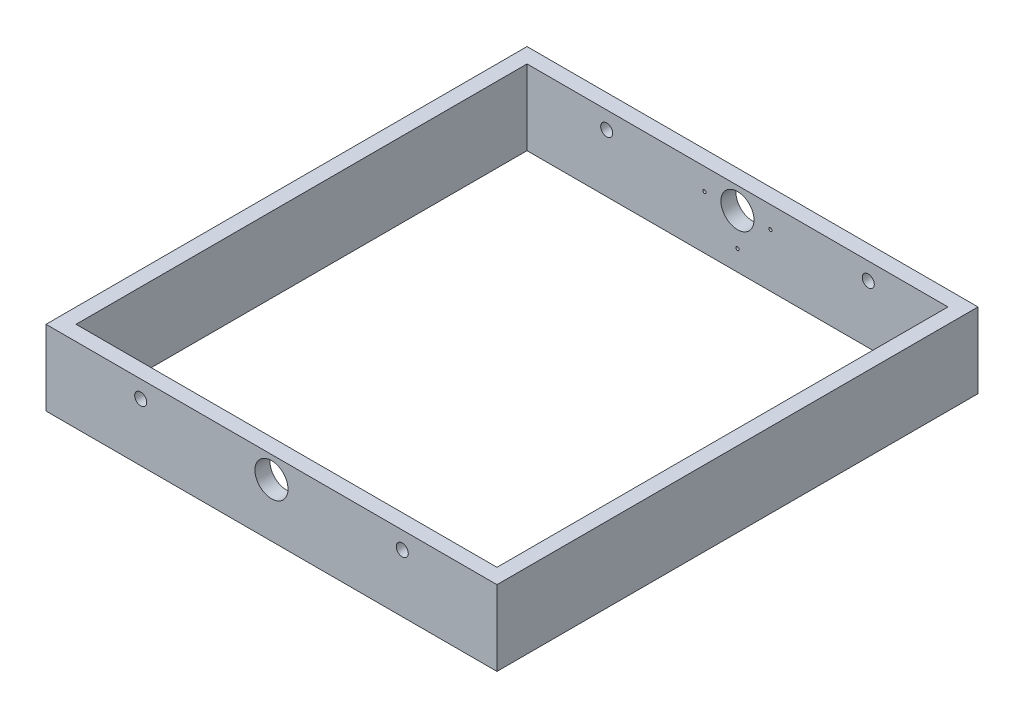
ISO-10303-21;
HEADER;
FILE_DESCRIPTION(('STEP AP214'),'2;1');
FILE_NAME('part.step','',(''),(''),'','','');
FILE_SCHEMA(('AUTOMOTIVE_DESIGN { 1 0 10303 214 1 1 1 1 }'));
ENDSEC;
DATA;
#1=APPLICATION_CONTEXT('core data for automotive mechanical design processes');
#2=APPLICATION_PROTOCOL_DEFINITION('international standard','automotive_design',2000,#1);
#3=PRODUCT_CONTEXT('',#1,'mechanical');
#4=PRODUCT('Part','Part','',(#3));
#5=PRODUCT_RELATED_PRODUCT_CATEGORY('part','',(#4));
#6=PRODUCT_DEFINITION_FORMATION('','',#4);
#7=PRODUCT_DEFINITION_CONTEXT('part definition',#1,'design');
#8=PRODUCT_DEFINITION('design','',#6,#7);
#9=PRODUCT_DEFINITION_SHAPE('','',#8);
#10=(LENGTH_UNIT() NAMED_UNIT(*) SI_UNIT(.MILLI.,.METRE.));
#11=(NAMED_UNIT(*) PLANE_ANGLE_UNIT() SI_UNIT($,.RADIAN.));
#12=(NAMED_UNIT(*) SI_UNIT($,.STERADIAN.) SOLID_ANGLE_UNIT());
#13=UNCERTAINTY_MEASURE_WITH_UNIT(LENGTH_MEASURE(1.E-05),#10,'distance_accuracy_value','');
#14=(GEOMETRIC_REPRESENTATION_CONTEXT(3) GLOBAL_UNCERTAINTY_ASSIGNED_CONTEXT((#13)) GLOBAL_UNIT_ASSIGNED_CONTEXT((#10,
#11,#12)) REPRESENTATION_CONTEXT('',''));
#15=CARTESIAN_POINT('',(0.,0.,0.));
#16=DIRECTION('',(0.,0.,1.));
#17=DIRECTION('',(1.,0.,0.));
#18=AXIS2_PLACEMENT_3D('',#15,#16,#17);
#19=CARTESIAN_POINT('',(0.,50.,0.));
#20=DIRECTION('',(0.,-1.,0.));
#21=DIRECTION('',(0.,0.,-1.));
#22=AXIS2_PLACEMENT_3D('',#19,#20,#21);
#23=PLANE('',#22);
#24=DIRECTION('',(0.,0.,-1.));
#25=VECTOR('',#24,1.);
#26=CARTESIAN_POINT('',(150.,50.,160.));
#27=LINE('',#26,#25);
#28=CARTESIAN_POINT('',(150.,50.,160.));
#29=VERTEX_POINT('',#28);
#30=CARTESIAN_POINT('',(150.,50.,-160.));
#31=VERTEX_POINT('',#30);
#32=EDGE_CURVE('E137',#29,#31,#27,.T.);
#33=ORIENTED_EDGE('',*,*,#32,.T.);
#34=DIRECTION('',(-1.,0.,0.));
#35=VECTOR('',#34,1.);
#36=CARTESIAN_POINT('',(-150.,50.,-160.));
#37=LINE('',#36,#35);
#38=CARTESIAN_POINT('',(-150.,50.,-160.));
#39=VERTEX_POINT('',#38);
#40=EDGE_CURVE('E140',#31,#39,#37,.T.);
#41=ORIENTED_EDGE('',*,*,#40,.T.);
#42=DIRECTION('',(0.,0.,1.));
#43=VECTOR('',#42,1.);
#44=CARTESIAN_POINT('',(-150.,50.,160.));
#45=LINE('',#44,#43);
#46=CARTESIAN_POINT('',(-150.,50.,160.));
#47=VERTEX_POINT('',#46);
#48=EDGE_CURVE('E143',#39,#47,#45,.T.);
#49=ORIENTED_EDGE('',*,*,#48,.T.);
#50=DIRECTION('',(1.,0.,0.));
#51=VECTOR('',#50,1.);
#52=CARTESIAN_POINT('',(-150.,50.,160.));
#53=LINE('',#52,#51);
#54=EDGE_CURVE('E145',#47,#29,#53,.T.);
#55=ORIENTED_EDGE('',*,*,#54,.T.);
#56=EDGE_LOOP('',(#33,#41,#49,#55));
#57=FACE_BOUND('',#56,.T.);
#58=DIRECTION('',(0.,0.,-1.));
#59=VECTOR('',#58,1.);
#60=CARTESIAN_POINT('',(140.,50.,-150.));
#61=LINE('',#60,#59);
#62=CARTESIAN_POINT('',(140.,50.,150.));
#63=VERTEX_POINT('',#62);
#64=CARTESIAN_POINT('',(140.,50.,-150.));
#65=VERTEX_POINT('',#64);
#66=EDGE_CURVE('E99',#63,#65,#61,.T.);
#67=ORIENTED_EDGE('',*,*,#66,.F.);
#68=DIRECTION('',(1.,0.,0.));
#69=VECTOR('',#68,1.);
#70=CARTESIAN_POINT('',(-140.,50.,150.));
#71=LINE('',#70,#69);
#72=CARTESIAN_POINT('',(-140.,50.,150.));
#73=VERTEX_POINT('',#72);
#74=EDGE_CURVE('E121',#73,#63,#71,.T.);
#75=ORIENTED_EDGE('',*,*,#74,.F.);
#76=DIRECTION('',(0.,0.,1.));
#77=VECTOR('',#76,1.);
#78=CARTESIAN_POINT('',(-140.,50.,-150.));
#79=LINE('',#78,#77);
#80=CARTESIAN_POINT('',(-140.,50.,-150.));
#81=VERTEX_POINT('',#80);
#82=EDGE_CURVE('E119',#81,#73,#79,.T.);
#83=ORIENTED_EDGE('',*,*,#82,.F.);
#84=DIRECTION('',(-1.,0.,0.));
#85=VECTOR('',#84,1.);
#86=CARTESIAN_POINT('',(-140.,50.,-150.));
#87=LINE('',#86,#85);
#88=EDGE_CURVE('E107',#65,#81,#87,.T.);
#89=ORIENTED_EDGE('',*,*,#88,.F.);
#90=EDGE_LOOP('',(#67,#75,#83,#89));
#91=FACE_BOUND('',#90,.T.);
#92=ADVANCED_FACE('F32',(#57,#91),#23,.F.);
#93=CARTESIAN_POINT('',(0.,0.,0.));
#94=DIRECTION('',(0.,-1.,0.));
#95=DIRECTION('',(0.,0.,-1.));
#96=AXIS2_PLACEMENT_3D('',#93,#94,#95);
#97=PLANE('',#96);
#98=DIRECTION('',(0.,0.,-1.));
#99=VECTOR('',#98,1.);
#100=CARTESIAN_POINT('',(150.,0.,160.));
#101=LINE('',#100,#99);
#102=CARTESIAN_POINT('',(150.,0.,160.));
#103=VERTEX_POINT('',#102);
#104=CARTESIAN_POINT('',(150.,0.,-160.));
#105=VERTEX_POINT('',#104);
#106=EDGE_CURVE('E115',#103,#105,#101,.T.);
#107=ORIENTED_EDGE('',*,*,#106,.F.);
#108=DIRECTION('',(1.,0.,0.));
#109=VECTOR('',#108,1.);
#110=CARTESIAN_POINT('',(-150.,0.,160.));
#111=LINE('',#110,#109);
#112=CARTESIAN_POINT('',(-150.,0.,160.));
#113=VERTEX_POINT('',#112);
#114=EDGE_CURVE('E141',#113,#103,#111,.T.);
#115=ORIENTED_EDGE('',*,*,#114,.F.);
#116=DIRECTION('',(0.,0.,1.));
#117=VECTOR('',#116,1.);
#118=CARTESIAN_POINT('',(-150.,0.,160.));
#119=LINE('',#118,#117);
#120=CARTESIAN_POINT('',(-150.,0.,-160.));
#121=VERTEX_POINT('',#120);
#122=EDGE_CURVE('E152',#121,#113,#119,.T.);
#123=ORIENTED_EDGE('',*,*,#122,.F.);
#124=DIRECTION('',(-1.,0.,0.));
#125=VECTOR('',#124,1.);
#126=CARTESIAN_POINT('',(-150.,0.,-160.));
#127=LINE('',#126,#125);
#128=EDGE_CURVE('E150',#105,#121,#127,.T.);
#129=ORIENTED_EDGE('',*,*,#128,.F.);
#130=EDGE_LOOP('',(#107,#115,#123,#129));
#131=FACE_BOUND('',#130,.T.);
#132=DIRECTION('',(1.,0.,0.));
#133=VECTOR('',#132,1.);
#134=CARTESIAN_POINT('',(-140.,0.,150.));
#135=LINE('',#134,#133);
#136=CARTESIAN_POINT('',(-140.,0.,150.));
#137=VERTEX_POINT('',#136);
#138=CARTESIAN_POINT('',(140.,0.,150.));
#139=VERTEX_POINT('',#138);
#140=EDGE_CURVE('E108',#137,#139,#135,.T.);
#141=ORIENTED_EDGE('',*,*,#140,.T.);
#142=DIRECTION('',(0.,0.,-1.));
#143=VECTOR('',#142,1.);
#144=CARTESIAN_POINT('',(140.,0.,-150.));
#145=LINE('',#144,#143);
#146=CARTESIAN_POINT('',(140.,0.,-150.));
#147=VERTEX_POINT('',#146);
#148=EDGE_CURVE('E57',#139,#147,#145,.T.);
#149=ORIENTED_EDGE('',*,*,#148,.T.);
#150=DIRECTION('',(-1.,0.,0.));
#151=VECTOR('',#150,1.);
#152=CARTESIAN_POINT('',(-140.,0.,-150.));
#153=LINE('',#152,#151);
#154=CARTESIAN_POINT('',(-140.,0.,-150.));
#155=VERTEX_POINT('',#154);
#156=EDGE_CURVE('E114',#147,#155,#153,.T.);
#157=ORIENTED_EDGE('',*,*,#156,.T.);
#158=DIRECTION('',(0.,0.,1.));
#159=VECTOR('',#158,1.);
#160=CARTESIAN_POINT('',(-140.,0.,-150.));
#161=LINE('',#160,#159);
#162=EDGE_CURVE('E129',#155,#137,#161,.T.);
#163=ORIENTED_EDGE('',*,*,#162,.T.);
#164=EDGE_LOOP('',(#141,#149,#157,#163));
#165=FACE_BOUND('',#164,.T.);
#166=ADVANCED_FACE('F199',(#131,#165),#97,.T.);
#167=CARTESIAN_POINT('',(150.,50.,160.));
#168=DIRECTION('',(-1.,0.,0.));
#169=DIRECTION('',(0.,0.,1.));
#170=AXIS2_PLACEMENT_3D('',#167,#168,#169);
#171=PLANE('',#170);
#172=ORIENTED_EDGE('',*,*,#106,.T.);
#173=DIRECTION('',(0.,-1.,0.));
#174=VECTOR('',#173,1.);
#175=CARTESIAN_POINT('',(150.,50.,-160.));
#176=LINE('',#175,#174);
#177=EDGE_CURVE('E11',#31,#105,#176,.T.);
#178=ORIENTED_EDGE('',*,*,#177,.F.);
#179=ORIENTED_EDGE('',*,*,#32,.F.);
#180=DIRECTION('',(0.,-1.,0.));
#181=VECTOR('',#180,1.);
#182=CARTESIAN_POINT('',(150.,50.,160.));
#183=LINE('',#182,#181);
#184=EDGE_CURVE('E147',#29,#103,#183,.T.);
#185=ORIENTED_EDGE('',*,*,#184,.T.);
#186=EDGE_LOOP('',(#172,#178,#179,#185));
#187=FACE_BOUND('',#186,.T.);
#188=ADVANCED_FACE('F34',(#187),#171,.F.);
#189=CARTESIAN_POINT('',(-150.,50.,-160.));
#190=DIRECTION('',(0.,0.,1.));
#191=DIRECTION('',(1.,0.,0.));
#192=AXIS2_PLACEMENT_3D('',#189,#190,#191);
#193=PLANE('',#192);
#194=CARTESIAN_POINT('',(0.,13.579689783217,-160.));
#195=DIRECTION('',(0.,0.,-1.));
#196=DIRECTION('',(-1.,0.,0.));
#197=AXIS2_PLACEMENT_3D('',#194,#195,#196);
#198=CIRCLE('',#197,1.09);
#199=CARTESIAN_POINT('',(-1.08999999999999,13.579689783217,-160.));
#200=VERTEX_POINT('',#199);
#201=EDGE_CURVE('E235',#200,#200,#198,.T.);
#202=ORIENTED_EDGE('',*,*,#201,.F.);
#203=EDGE_LOOP('',(#202));
#204=FACE_BOUND('',#203,.T.);
#205=CARTESIAN_POINT('',(21.920310216783,35.5,-160.));
#206=DIRECTION('',(0.,0.,-1.));
#207=DIRECTION('',(-1.,0.,0.));
#208=AXIS2_PLACEMENT_3D('',#205,#206,#207);
#209=CIRCLE('',#208,1.09);
#210=CARTESIAN_POINT('',(20.830310216783,35.5,-160.));
#211=VERTEX_POINT('',#210);
#212=EDGE_CURVE('E239',#211,#211,#209,.T.);
#213=ORIENTED_EDGE('',*,*,#212,.F.);
#214=EDGE_LOOP('',(#213));
#215=FACE_BOUND('',#214,.T.);
#216=CARTESIAN_POINT('',(-21.920310216783,35.5,-160.));
#217=DIRECTION('',(0.,0.,-1.));
#218=DIRECTION('',(-1.,0.,0.));
#219=AXIS2_PLACEMENT_3D('',#216,#217,#218);
#220=CIRCLE('',#219,1.09);
#221=CARTESIAN_POINT('',(-23.010310216783,35.5,-160.));
#222=VERTEX_POINT('',#221);
#223=EDGE_CURVE('E243',#222,#222,#220,.T.);
#224=ORIENTED_EDGE('',*,*,#223,.F.);
#225=EDGE_LOOP('',(#224));
#226=FACE_BOUND('',#225,.T.);
#227=CARTESIAN_POINT('',(-87.,38.5,-160.));
#228=DIRECTION('',(0.,0.,1.));
#229=DIRECTION('',(1.,0.,0.));
#230=AXIS2_PLACEMENT_3D('',#227,#228,#229);
#231=CIRCLE('',#230,4.00000000000001);
#232=CARTESIAN_POINT('',(-83.,38.5,-160.));
#233=VERTEX_POINT('',#232);
#234=EDGE_CURVE('E165',#233,#233,#231,.T.);
#235=ORIENTED_EDGE('',*,*,#234,.T.);
#236=EDGE_LOOP('',(#235));
#237=FACE_BOUND('',#236,.T.);
#238=CARTESIAN_POINT('',(0.,35.5,-160.));
#239=DIRECTION('',(0.,0.,1.));
#240=DIRECTION('',(1.,0.,0.));
#241=AXIS2_PLACEMENT_3D('',#238,#239,#240);
#242=CIRCLE('',#241,11.);
#243=CARTESIAN_POINT('',(11.,35.5,-160.));
#244=VERTEX_POINT('',#243);
#245=EDGE_CURVE('E250',#244,#244,#242,.T.);
#246=ORIENTED_EDGE('',*,*,#245,.T.);
#247=EDGE_LOOP('',(#246));
#248=FACE_BOUND('',#247,.T.);
#249=CARTESIAN_POINT('',(87.,38.5,-160.));
#250=DIRECTION('',(0.,0.,1.));
#251=DIRECTION('',(1.,0.,0.));
#252=AXIS2_PLACEMENT_3D('',#249,#250,#251);
#253=CIRCLE('',#252,4.00000000000001);
#254=CARTESIAN_POINT('',(91.,38.5,-160.));
#255=VERTEX_POINT('',#254);
#256=EDGE_CURVE('E254',#255,#255,#253,.T.);
#257=ORIENTED_EDGE('',*,*,#256,.T.);
#258=EDGE_LOOP('',(#257));
#259=FACE_BOUND('',#258,.T.);
#260=ORIENTED_EDGE('',*,*,#128,.T.);
#261=DIRECTION('',(0.,-1.,0.));
#262=VECTOR('',#261,1.);
#263=CARTESIAN_POINT('',(-150.,50.,-160.));
#264=LINE('',#263,#262);
#265=EDGE_CURVE('E41',#39,#121,#264,.T.);
#266=ORIENTED_EDGE('',*,*,#265,.F.);
#267=ORIENTED_EDGE('',*,*,#40,.F.);
#268=ORIENTED_EDGE('',*,*,#177,.T.);
#269=EDGE_LOOP('',(#260,#266,#267,#268));
#270=FACE_BOUND('',#269,.T.);
#271=ADVANCED_FACE('F224',(#204,#215,#226,#237,#248,#259,#270),#193,.F.);
#272=CARTESIAN_POINT('',(-150.,50.,160.));
#273=DIRECTION('',(1.,0.,0.));
#274=DIRECTION('',(0.,0.,-1.));
#275=AXIS2_PLACEMENT_3D('',#272,#273,#274);
#276=PLANE('',#275);
#277=ORIENTED_EDGE('',*,*,#122,.T.);
#278=DIRECTION('',(0.,-1.,0.));
#279=VECTOR('',#278,1.);
#280=CARTESIAN_POINT('',(-150.,50.,160.));
#281=LINE('',#280,#279);
#282=EDGE_CURVE('E157',#47,#113,#281,.T.);
#283=ORIENTED_EDGE('',*,*,#282,.F.);
#284=ORIENTED_EDGE('',*,*,#48,.F.);
#285=ORIENTED_EDGE('',*,*,#265,.T.);
#286=EDGE_LOOP('',(#277,#283,#284,#285));
#287=FACE_BOUND('',#286,.T.);
#288=ADVANCED_FACE('F221',(#287),#276,.F.);
#289=CARTESIAN_POINT('',(-150.,50.,160.));
#290=DIRECTION('',(0.,0.,-1.));
#291=DIRECTION('',(-1.,0.,0.));
#292=AXIS2_PLACEMENT_3D('',#289,#290,#291);
#293=PLANE('',#292);
#294=CARTESIAN_POINT('',(-87.,38.5,160.));
#295=DIRECTION('',(0.,0.,1.));
#296=DIRECTION('',(1.,0.,0.));
#297=AXIS2_PLACEMENT_3D('',#294,#295,#296);
#298=CIRCLE('',#297,4.00000000000001);
#299=CARTESIAN_POINT('',(-83.,38.5,160.));
#300=VERTEX_POINT('',#299);
#301=EDGE_CURVE('E274',#300,#300,#298,.T.);
#302=ORIENTED_EDGE('',*,*,#301,.F.);
#303=EDGE_LOOP('',(#302));
#304=FACE_BOUND('',#303,.T.);
#305=CARTESIAN_POINT('',(0.,35.5,160.));
#306=DIRECTION('',(0.,0.,1.));
#307=DIRECTION('',(1.,0.,0.));
#308=AXIS2_PLACEMENT_3D('',#305,#306,#307);
#309=CIRCLE('',#308,11.);
#310=CARTESIAN_POINT('',(11.,35.5,160.));
#311=VERTEX_POINT('',#310);
#312=EDGE_CURVE('E267',#311,#311,#309,.T.);
#313=ORIENTED_EDGE('',*,*,#312,.F.);
#314=EDGE_LOOP('',(#313));
#315=FACE_BOUND('',#314,.T.);
#316=CARTESIAN_POINT('',(87.,38.5,160.));
#317=DIRECTION('',(0.,0.,1.));
#318=DIRECTION('',(1.,0.,0.));
#319=AXIS2_PLACEMENT_3D('',#316,#317,#318);
#320=CIRCLE('',#319,4.00000000000001);
#321=CARTESIAN_POINT('',(91.,38.5,160.));
#322=VERTEX_POINT('',#321);
#323=EDGE_CURVE('E178',#322,#322,#320,.T.);
#324=ORIENTED_EDGE('',*,*,#323,.F.);
#325=EDGE_LOOP('',(#324));
#326=FACE_BOUND('',#325,.T.);
#327=ORIENTED_EDGE('',*,*,#114,.T.);
#328=ORIENTED_EDGE('',*,*,#184,.F.);
#329=ORIENTED_EDGE('',*,*,#54,.F.);
#330=ORIENTED_EDGE('',*,*,#282,.T.);
#331=EDGE_LOOP('',(#327,#328,#329,#330));
#332=FACE_BOUND('',#331,.T.);
#333=ADVANCED_FACE('F218',(#304,#315,#326,#332),#293,.F.);
#334=CARTESIAN_POINT('',(140.,50.,-150.));
#335=DIRECTION('',(-1.,0.,0.));
#336=DIRECTION('',(0.,0.,1.));
#337=AXIS2_PLACEMENT_3D('',#334,#335,#336);
#338=PLANE('',#337);
#339=ORIENTED_EDGE('',*,*,#148,.F.);
#340=DIRECTION('',(0.,-1.,0.));
#341=VECTOR('',#340,1.);
#342=CARTESIAN_POINT('',(140.,50.,150.));
#343=LINE('',#342,#341);
#344=EDGE_CURVE('E103',#63,#139,#343,.T.);
#345=ORIENTED_EDGE('',*,*,#344,.F.);
#346=ORIENTED_EDGE('',*,*,#66,.T.);
#347=DIRECTION('',(0.,-1.,0.));
#348=VECTOR('',#347,1.);
#349=CARTESIAN_POINT('',(140.,50.,-150.));
#350=LINE('',#349,#348);
#351=EDGE_CURVE('E102',#65,#147,#350,.T.);
#352=ORIENTED_EDGE('',*,*,#351,.T.);
#353=EDGE_LOOP('',(#339,#345,#346,#352));
#354=FACE_BOUND('',#353,.T.);
#355=ADVANCED_FACE('F101',(#354),#338,.T.);
#356=CARTESIAN_POINT('',(-140.,50.,-150.));
#357=DIRECTION('',(0.,0.,1.));
#358=DIRECTION('',(1.,0.,0.));
#359=AXIS2_PLACEMENT_3D('',#356,#357,#358);
#360=PLANE('',#359);
#361=CARTESIAN_POINT('',(0.,13.579689783217,-150.));
#362=DIRECTION('',(0.,0.,1.));
#363=DIRECTION('',(1.,0.,0.));
#364=AXIS2_PLACEMENT_3D('',#361,#362,#363);
#365=CIRCLE('',#364,1.09);
#366=CARTESIAN_POINT('',(1.09000000000001,13.579689783217,-150.));
#367=VERTEX_POINT('',#366);
#368=EDGE_CURVE('E271',#367,#367,#365,.F.);
#369=ORIENTED_EDGE('',*,*,#368,.T.);
#370=EDGE_LOOP('',(#369));
#371=FACE_BOUND('',#370,.T.);
#372=CARTESIAN_POINT('',(21.920310216783,35.5,-150.));
#373=DIRECTION('',(0.,0.,1.));
#374=DIRECTION('',(1.,0.,0.));
#375=AXIS2_PLACEMENT_3D('',#372,#373,#374);
#376=CIRCLE('',#375,1.09);
#377=CARTESIAN_POINT('',(23.010310216783,35.5,-150.));
#378=VERTEX_POINT('',#377);
#379=EDGE_CURVE('E282',#378,#378,#376,.F.);
#380=ORIENTED_EDGE('',*,*,#379,.T.);
#381=EDGE_LOOP('',(#380));
#382=FACE_BOUND('',#381,.T.);
#383=CARTESIAN_POINT('',(-21.920310216783,35.5,-150.));
#384=DIRECTION('',(0.,0.,1.));
#385=DIRECTION('',(1.,0.,0.));
#386=AXIS2_PLACEMENT_3D('',#383,#384,#385);
#387=CIRCLE('',#386,1.09);
#388=CARTESIAN_POINT('',(-20.830310216783,35.5,-150.));
#389=VERTEX_POINT('',#388);
#390=EDGE_CURVE('E278',#389,#389,#387,.F.);
#391=ORIENTED_EDGE('',*,*,#390,.T.);
#392=EDGE_LOOP('',(#391));
#393=FACE_BOUND('',#392,.T.);
#394=CARTESIAN_POINT('',(-87.,38.5,-150.));
#395=DIRECTION('',(0.,0.,1.));
#396=DIRECTION('',(1.,0.,0.));
#397=AXIS2_PLACEMENT_3D('',#394,#395,#396);
#398=CIRCLE('',#397,4.00000000000001);
#399=CARTESIAN_POINT('',(-83.,38.5,-150.));
#400=VERTEX_POINT('',#399);
#401=EDGE_CURVE('E127',#400,#400,#398,.T.);
#402=ORIENTED_EDGE('',*,*,#401,.F.);
#403=EDGE_LOOP('',(#402));
#404=FACE_BOUND('',#403,.T.);
#405=CARTESIAN_POINT('',(0.,35.5,-150.));
#406=DIRECTION('',(0.,0.,1.));
#407=DIRECTION('',(1.,0.,0.));
#408=AXIS2_PLACEMENT_3D('',#405,#406,#407);
#409=CIRCLE('',#408,11.);
#410=CARTESIAN_POINT('',(11.,35.5,-150.));
#411=VERTEX_POINT('',#410);
#412=EDGE_CURVE('E168',#411,#411,#409,.T.);
#413=ORIENTED_EDGE('',*,*,#412,.F.);
#414=EDGE_LOOP('',(#413));
#415=FACE_BOUND('',#414,.T.);
#416=CARTESIAN_POINT('',(87.,38.5,-150.));
#417=DIRECTION('',(0.,0.,1.));
#418=DIRECTION('',(1.,0.,0.));
#419=AXIS2_PLACEMENT_3D('',#416,#417,#418);
#420=CIRCLE('',#419,4.00000000000001);
#421=CARTESIAN_POINT('',(91.,38.5,-150.));
#422=VERTEX_POINT('',#421);
#423=EDGE_CURVE('E164',#422,#422,#420,.T.);
#424=ORIENTED_EDGE('',*,*,#423,.F.);
#425=EDGE_LOOP('',(#424));
#426=FACE_BOUND('',#425,.T.);
#427=ORIENTED_EDGE('',*,*,#156,.F.);
#428=ORIENTED_EDGE('',*,*,#351,.F.);
#429=ORIENTED_EDGE('',*,*,#88,.T.);
#430=DIRECTION('',(0.,-1.,0.));
#431=VECTOR('',#430,1.);
#432=CARTESIAN_POINT('',(-140.,50.,-150.));
#433=LINE('',#432,#431);
#434=EDGE_CURVE('E116',#81,#155,#433,.T.);
#435=ORIENTED_EDGE('',*,*,#434,.T.);
#436=EDGE_LOOP('',(#427,#428,#429,#435));
#437=FACE_BOUND('',#436,.T.);
#438=ADVANCED_FACE('F111',(#371,#382,#393,#404,#415,#426,#437),#360,.T.);
#439=CARTESIAN_POINT('',(-140.,50.,-150.));
#440=DIRECTION('',(1.,0.,0.));
#441=DIRECTION('',(0.,0.,-1.));
#442=AXIS2_PLACEMENT_3D('',#439,#440,#441);
#443=PLANE('',#442);
#444=ORIENTED_EDGE('',*,*,#162,.F.);
#445=ORIENTED_EDGE('',*,*,#434,.F.);
#446=ORIENTED_EDGE('',*,*,#82,.T.);
#447=DIRECTION('',(0.,-1.,0.));
#448=VECTOR('',#447,1.);
#449=CARTESIAN_POINT('',(-140.,50.,150.));
#450=LINE('',#449,#448);
#451=EDGE_CURVE('E49',#73,#137,#450,.T.);
#452=ORIENTED_EDGE('',*,*,#451,.T.);
#453=EDGE_LOOP('',(#444,#445,#446,#452));
#454=FACE_BOUND('',#453,.T.);
#455=ADVANCED_FACE('F193',(#454),#443,.T.);
#456=CARTESIAN_POINT('',(-140.,50.,150.));
#457=DIRECTION('',(0.,0.,-1.));
#458=DIRECTION('',(-1.,0.,0.));
#459=AXIS2_PLACEMENT_3D('',#456,#457,#458);
#460=PLANE('',#459);
#461=CARTESIAN_POINT('',(-87.,38.5,150.));
#462=DIRECTION('',(0.,0.,-1.));
#463=DIRECTION('',(-1.,0.,0.));
#464=AXIS2_PLACEMENT_3D('',#461,#462,#463);
#465=CIRCLE('',#464,4.00000000000001);
#466=CARTESIAN_POINT('',(-91.,38.5,150.));
#467=VERTEX_POINT('',#466);
#468=EDGE_CURVE('E36',#467,#467,#465,.T.);
#469=ORIENTED_EDGE('',*,*,#468,.F.);
#470=EDGE_LOOP('',(#469));
#471=FACE_BOUND('',#470,.T.);
#472=CARTESIAN_POINT('',(0.,35.5,150.));
#473=DIRECTION('',(0.,0.,-1.));
#474=DIRECTION('',(-1.,0.,0.));
#475=AXIS2_PLACEMENT_3D('',#472,#473,#474);
#476=CIRCLE('',#475,11.);
#477=CARTESIAN_POINT('',(-11.,35.5,150.));
#478=VERTEX_POINT('',#477);
#479=EDGE_CURVE('E166',#478,#478,#476,.T.);
#480=ORIENTED_EDGE('',*,*,#479,.F.);
#481=EDGE_LOOP('',(#480));
#482=FACE_BOUND('',#481,.T.);
#483=CARTESIAN_POINT('',(87.,38.5,150.));
#484=DIRECTION('',(0.,0.,-1.));
#485=DIRECTION('',(-1.,0.,0.));
#486=AXIS2_PLACEMENT_3D('',#483,#484,#485);
#487=CIRCLE('',#486,4.00000000000001);
#488=CARTESIAN_POINT('',(83.,38.5,150.));
#489=VERTEX_POINT('',#488);
#490=EDGE_CURVE('E162',#489,#489,#487,.T.);
#491=ORIENTED_EDGE('',*,*,#490,.F.);
#492=EDGE_LOOP('',(#491));
#493=FACE_BOUND('',#492,.T.);
#494=ORIENTED_EDGE('',*,*,#140,.F.);
#495=ORIENTED_EDGE('',*,*,#451,.F.);
#496=ORIENTED_EDGE('',*,*,#74,.T.);
#497=ORIENTED_EDGE('',*,*,#344,.T.);
#498=EDGE_LOOP('',(#494,#495,#496,#497));
#499=FACE_BOUND('',#498,.T.);
#500=ADVANCED_FACE('F189',(#471,#482,#493,#499),#460,.T.);
#501=CARTESIAN_POINT('',(87.,38.5,-160.));
#502=DIRECTION('',(0.,0.,1.));
#503=DIRECTION('',(1.,0.,0.));
#504=AXIS2_PLACEMENT_3D('',#501,#502,#503);
#505=CYLINDRICAL_SURFACE('',#504,4.00000000000001);
#506=ORIENTED_EDGE('',*,*,#490,.T.);
#507=EDGE_LOOP('',(#506));
#508=FACE_BOUND('',#507,.T.);
#509=ORIENTED_EDGE('',*,*,#323,.T.);
#510=EDGE_LOOP('',(#509));
#511=FACE_BOUND('',#510,.T.);
#512=ADVANCED_FACE('F192',(#508,#511),#505,.F.);
#513=CARTESIAN_POINT('',(0.,35.5,-160.));
#514=DIRECTION('',(0.,0.,1.));
#515=DIRECTION('',(1.,0.,0.));
#516=AXIS2_PLACEMENT_3D('',#513,#514,#515);
#517=CYLINDRICAL_SURFACE('',#516,11.);
#518=ORIENTED_EDGE('',*,*,#479,.T.);
#519=EDGE_LOOP('',(#518));
#520=FACE_BOUND('',#519,.T.);
#521=ORIENTED_EDGE('',*,*,#312,.T.);
#522=EDGE_LOOP('',(#521));
#523=FACE_BOUND('',#522,.T.);
#524=ADVANCED_FACE('F310',(#520,#523),#517,.F.);
#525=CARTESIAN_POINT('',(-87.,38.5,-160.));
#526=DIRECTION('',(0.,0.,1.));
#527=DIRECTION('',(1.,0.,0.));
#528=AXIS2_PLACEMENT_3D('',#525,#526,#527);
#529=CYLINDRICAL_SURFACE('',#528,4.00000000000001);
#530=ORIENTED_EDGE('',*,*,#468,.T.);
#531=EDGE_LOOP('',(#530));
#532=FACE_BOUND('',#531,.T.);
#533=ORIENTED_EDGE('',*,*,#301,.T.);
#534=EDGE_LOOP('',(#533));
#535=FACE_BOUND('',#534,.T.);
#536=ADVANCED_FACE('F186',(#532,#535),#529,.F.);
#537=ORIENTED_EDGE('',*,*,#423,.T.);
#538=EDGE_LOOP('',(#537));
#539=FACE_BOUND('',#538,.T.);
#540=ORIENTED_EDGE('',*,*,#256,.F.);
#541=EDGE_LOOP('',(#540));
#542=FACE_BOUND('',#541,.T.);
#543=ADVANCED_FACE('F308',(#539,#542),#505,.F.);
#544=ORIENTED_EDGE('',*,*,#412,.T.);
#545=EDGE_LOOP('',(#544));
#546=FACE_BOUND('',#545,.T.);
#547=ORIENTED_EDGE('',*,*,#245,.F.);
#548=EDGE_LOOP('',(#547));
#549=FACE_BOUND('',#548,.T.);
#550=ADVANCED_FACE('F304',(#546,#549),#517,.F.);
#551=ORIENTED_EDGE('',*,*,#401,.T.);
#552=EDGE_LOOP('',(#551));
#553=FACE_BOUND('',#552,.T.);
#554=ORIENTED_EDGE('',*,*,#234,.F.);
#555=EDGE_LOOP('',(#554));
#556=FACE_BOUND('',#555,.T.);
#557=ADVANCED_FACE('F307',(#553,#556),#529,.F.);
#558=CARTESIAN_POINT('',(-21.920310216783,35.5,-146.917014434027));
#559=DIRECTION('',(0.,0.,-1.));
#560=DIRECTION('',(-1.,0.,0.));
#561=AXIS2_PLACEMENT_3D('',#558,#559,#560);
#562=CYLINDRICAL_SURFACE('',#561,1.09);
#563=ORIENTED_EDGE('',*,*,#223,.T.);
#564=EDGE_LOOP('',(#563));
#565=FACE_BOUND('',#564,.T.);
#566=ORIENTED_EDGE('',*,*,#390,.F.);
#567=EDGE_LOOP('',(#566));
#568=FACE_BOUND('',#567,.T.);
#569=ADVANCED_FACE('F315',(#565,#568),#562,.F.);
#570=CARTESIAN_POINT('',(21.920310216783,35.5,-146.917014434027));
#571=DIRECTION('',(0.,0.,-1.));
#572=DIRECTION('',(-1.,0.,0.));
#573=AXIS2_PLACEMENT_3D('',#570,#571,#572);
#574=CYLINDRICAL_SURFACE('',#573,1.09);
#575=ORIENTED_EDGE('',*,*,#212,.T.);
#576=EDGE_LOOP('',(#575));
#577=FACE_BOUND('',#576,.T.);
#578=ORIENTED_EDGE('',*,*,#379,.F.);
#579=EDGE_LOOP('',(#578));
#580=FACE_BOUND('',#579,.T.);
#581=ADVANCED_FACE('F292',(#577,#580),#574,.F.);
#582=CARTESIAN_POINT('',(0.,13.579689783217,-146.917014434027));
#583=DIRECTION('',(0.,0.,-1.));
#584=DIRECTION('',(-1.,0.,0.));
#585=AXIS2_PLACEMENT_3D('',#582,#583,#584);
#586=CYLINDRICAL_SURFACE('',#585,1.09);
#587=ORIENTED_EDGE('',*,*,#201,.T.);
#588=EDGE_LOOP('',(#587));
#589=FACE_BOUND('',#588,.T.);
#590=ORIENTED_EDGE('',*,*,#368,.F.);
#591=EDGE_LOOP('',(#590));
#592=FACE_BOUND('',#591,.T.);
#593=ADVANCED_FACE('F289',(#589,#592),#586,.F.);
#594=CLOSED_SHELL('',(#92,#166,#188,#271,#288,#333,#355,#438,#455,#500,#512,#524,#536,#543,#550,
#557,#569,#581,#593));
#595=MANIFOLD_SOLID_BREP('B2',#594);
#596=ADVANCED_BREP_SHAPE_REPRESENTATION('',(#18,#595),#14);
#597=SHAPE_DEFINITION_REPRESENTATION(#9,#596);
ENDSEC;
END-ISO-10303-21;
